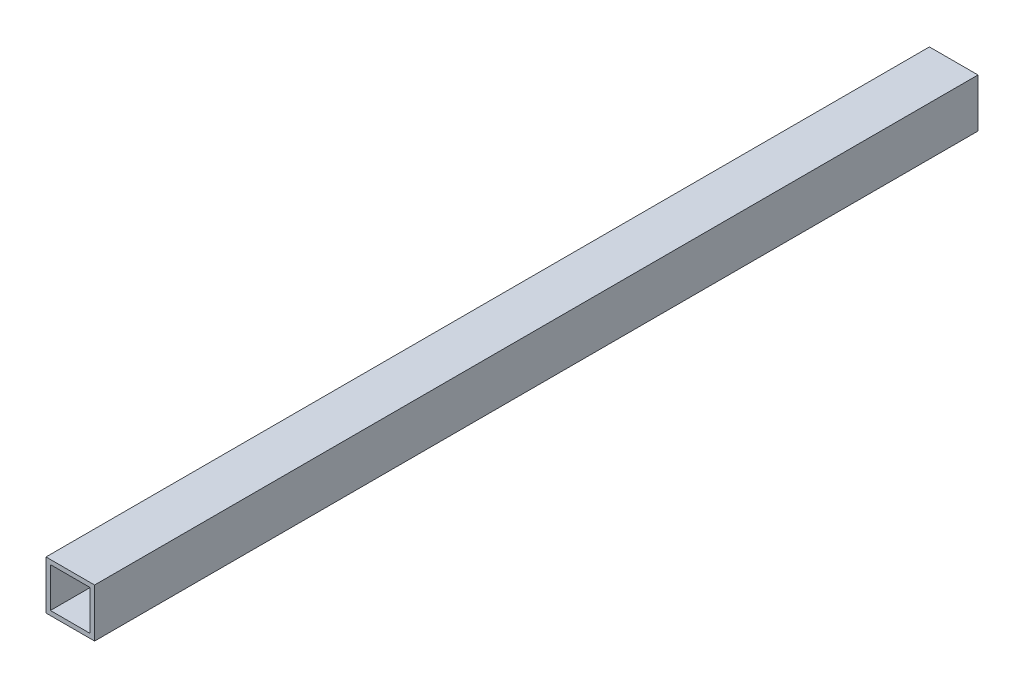
ISO-10303-21;
HEADER;
FILE_DESCRIPTION(('STEP AP214'),'2;1');
FILE_NAME('part.step','',(''),(''),'','','');
FILE_SCHEMA(('AUTOMOTIVE_DESIGN { 1 0 10303 214 1 1 1 1 }'));
ENDSEC;
DATA;
#1=APPLICATION_CONTEXT('core data for automotive mechanical design processes');
#2=APPLICATION_PROTOCOL_DEFINITION('international standard','automotive_design',2000,#1);
#3=PRODUCT_CONTEXT('',#1,'mechanical');
#4=PRODUCT('Part','Part','',(#3));
#5=PRODUCT_RELATED_PRODUCT_CATEGORY('part','',(#4));
#6=PRODUCT_DEFINITION_FORMATION('','',#4);
#7=PRODUCT_DEFINITION_CONTEXT('part definition',#1,'design');
#8=PRODUCT_DEFINITION('design','',#6,#7);
#9=PRODUCT_DEFINITION_SHAPE('','',#8);
#10=(LENGTH_UNIT() NAMED_UNIT(*) SI_UNIT(.MILLI.,.METRE.));
#11=(NAMED_UNIT(*) PLANE_ANGLE_UNIT() SI_UNIT($,.RADIAN.));
#12=(NAMED_UNIT(*) SI_UNIT($,.STERADIAN.) SOLID_ANGLE_UNIT());
#13=UNCERTAINTY_MEASURE_WITH_UNIT(LENGTH_MEASURE(1.E-05),#10,'distance_accuracy_value','');
#14=(GEOMETRIC_REPRESENTATION_CONTEXT(3) GLOBAL_UNCERTAINTY_ASSIGNED_CONTEXT((#13)) GLOBAL_UNIT_ASSIGNED_CONTEXT((#10,
#11,#12)) REPRESENTATION_CONTEXT('',''));
#15=CARTESIAN_POINT('',(0.,0.,0.));
#16=DIRECTION('',(0.,0.,1.));
#17=DIRECTION('',(1.,0.,0.));
#18=AXIS2_PLACEMENT_3D('',#15,#16,#17);
#19=CARTESIAN_POINT('',(0.,0.,400.));
#20=DIRECTION('',(0.,0.,1.));
#21=DIRECTION('',(1.,0.,0.));
#22=AXIS2_PLACEMENT_3D('',#19,#20,#21);
#23=PLANE('',#22);
#24=DIRECTION('',(0.,1.,0.));
#25=VECTOR('',#24,1.);
#26=CARTESIAN_POINT('',(3.29411764705882,39.0294117647059,400.));
#27=LINE('',#26,#25);
#28=CARTESIAN_POINT('',(3.29411764705882,-2.97058823529412,400.));
#29=VERTEX_POINT('',#28);
#30=CARTESIAN_POINT('',(3.29411764705882,41.0294117647059,400.));
#31=VERTEX_POINT('',#30);
#32=EDGE_CURVE('E177',#29,#31,#27,.T.);
#33=ORIENTED_EDGE('',*,*,#32,.T.);
#34=DIRECTION('',(-1.,0.,0.));
#35=VECTOR('',#34,1.);
#36=CARTESIAN_POINT('',(-38.7058823529412,41.0294117647059,400.));
#37=LINE('',#36,#35);
#38=CARTESIAN_POINT('',(-40.7058823529412,41.0294117647059,400.));
#39=VERTEX_POINT('',#38);
#40=EDGE_CURVE('E181',#31,#39,#37,.T.);
#41=ORIENTED_EDGE('',*,*,#40,.T.);
#42=DIRECTION('',(0.,-1.,0.));
#43=VECTOR('',#42,1.);
#44=CARTESIAN_POINT('',(-40.7058823529412,39.0294117647059,400.));
#45=LINE('',#44,#43);
#46=CARTESIAN_POINT('',(-40.7058823529412,-2.97058823529412,400.));
#47=VERTEX_POINT('',#46);
#48=EDGE_CURVE('E185',#39,#47,#45,.T.);
#49=ORIENTED_EDGE('',*,*,#48,.T.);
#50=DIRECTION('',(1.,0.,0.));
#51=VECTOR('',#50,1.);
#52=CARTESIAN_POINT('',(-38.7058823529412,-2.97058823529412,400.));
#53=LINE('',#52,#51);
#54=EDGE_CURVE('E188',#47,#29,#53,.T.);
#55=ORIENTED_EDGE('',*,*,#54,.T.);
#56=EDGE_LOOP('',(#33,#41,#49,#55));
#57=FACE_BOUND('',#56,.T.);
#58=DIRECTION('',(-1.,0.,0.));
#59=VECTOR('',#58,1.);
#60=CARTESIAN_POINT('',(-38.7058823529412,37.0294117647059,400.));
#61=LINE('',#60,#59);
#62=CARTESIAN_POINT('',(-0.705882352941183,37.0294117647059,400.));
#63=VERTEX_POINT('',#62);
#64=CARTESIAN_POINT('',(-36.7058823529412,37.0294117647059,400.));
#65=VERTEX_POINT('',#64);
#66=EDGE_CURVE('E138',#63,#65,#61,.T.);
#67=ORIENTED_EDGE('',*,*,#66,.F.);
#68=DIRECTION('',(0.,1.,0.));
#69=VECTOR('',#68,1.);
#70=CARTESIAN_POINT('',(-0.705882352941183,39.0294117647059,400.));
#71=LINE('',#70,#69);
#72=CARTESIAN_POINT('',(-0.705882352941178,1.02941176470588,400.));
#73=VERTEX_POINT('',#72);
#74=EDGE_CURVE('E129',#73,#63,#71,.T.);
#75=ORIENTED_EDGE('',*,*,#74,.F.);
#76=DIRECTION('',(1.,0.,0.));
#77=VECTOR('',#76,1.);
#78=CARTESIAN_POINT('',(-38.7058823529412,1.02941176470588,400.));
#79=LINE('',#78,#77);
#80=CARTESIAN_POINT('',(-36.7058823529412,1.02941176470588,400.));
#81=VERTEX_POINT('',#80);
#82=EDGE_CURVE('E155',#81,#73,#79,.T.);
#83=ORIENTED_EDGE('',*,*,#82,.F.);
#84=DIRECTION('',(0.,-1.,0.));
#85=VECTOR('',#84,1.);
#86=CARTESIAN_POINT('',(-36.7058823529412,39.0294117647059,400.));
#87=LINE('',#86,#85);
#88=EDGE_CURVE('E151',#65,#81,#87,.T.);
#89=ORIENTED_EDGE('',*,*,#88,.F.);
#90=EDGE_LOOP('',(#67,#75,#83,#89));
#91=FACE_BOUND('',#90,.T.);
#92=ADVANCED_FACE('F63',(#57,#91),#23,.T.);
#93=CARTESIAN_POINT('',(0.,0.,-400.));
#94=DIRECTION('',(0.,0.,1.));
#95=DIRECTION('',(1.,0.,0.));
#96=AXIS2_PLACEMENT_3D('',#93,#94,#95);
#97=PLANE('',#96);
#98=DIRECTION('',(0.,1.,0.));
#99=VECTOR('',#98,1.);
#100=CARTESIAN_POINT('',(3.29411764705882,39.0294117647059,-400.));
#101=LINE('',#100,#99);
#102=CARTESIAN_POINT('',(3.29411764705882,-2.97058823529412,-400.));
#103=VERTEX_POINT('',#102);
#104=CARTESIAN_POINT('',(3.29411764705882,41.0294117647059,-400.));
#105=VERTEX_POINT('',#104);
#106=EDGE_CURVE('E147',#103,#105,#101,.T.);
#107=ORIENTED_EDGE('',*,*,#106,.F.);
#108=DIRECTION('',(1.,0.,0.));
#109=VECTOR('',#108,1.);
#110=CARTESIAN_POINT('',(-38.7058823529412,-2.97058823529412,-400.));
#111=LINE('',#110,#109);
#112=CARTESIAN_POINT('',(-40.7058823529412,-2.97058823529412,-400.));
#113=VERTEX_POINT('',#112);
#114=EDGE_CURVE('E182',#113,#103,#111,.T.);
#115=ORIENTED_EDGE('',*,*,#114,.F.);
#116=DIRECTION('',(0.,-1.,0.));
#117=VECTOR('',#116,1.);
#118=CARTESIAN_POINT('',(-40.7058823529412,39.0294117647059,-400.));
#119=LINE('',#118,#117);
#120=CARTESIAN_POINT('',(-40.7058823529412,41.0294117647059,-400.));
#121=VERTEX_POINT('',#120);
#122=EDGE_CURVE('E198',#121,#113,#119,.T.);
#123=ORIENTED_EDGE('',*,*,#122,.F.);
#124=DIRECTION('',(-1.,0.,0.));
#125=VECTOR('',#124,1.);
#126=CARTESIAN_POINT('',(-38.7058823529412,41.0294117647059,-400.));
#127=LINE('',#126,#125);
#128=EDGE_CURVE('E195',#105,#121,#127,.T.);
#129=ORIENTED_EDGE('',*,*,#128,.F.);
#130=EDGE_LOOP('',(#107,#115,#123,#129));
#131=FACE_BOUND('',#130,.T.);
#132=DIRECTION('',(0.,1.,0.));
#133=VECTOR('',#132,1.);
#134=CARTESIAN_POINT('',(-0.705882352941183,39.0294117647059,-400.));
#135=LINE('',#134,#133);
#136=CARTESIAN_POINT('',(-0.705882352941178,1.02941176470588,-400.));
#137=VERTEX_POINT('',#136);
#138=CARTESIAN_POINT('',(-0.705882352941183,37.0294117647059,-400.));
#139=VERTEX_POINT('',#138);
#140=EDGE_CURVE('E87',#137,#139,#135,.T.);
#141=ORIENTED_EDGE('',*,*,#140,.T.);
#142=DIRECTION('',(-1.,0.,0.));
#143=VECTOR('',#142,1.);
#144=CARTESIAN_POINT('',(-38.7058823529412,37.0294117647059,-400.));
#145=LINE('',#144,#143);
#146=CARTESIAN_POINT('',(-36.7058823529412,37.0294117647059,-400.));
#147=VERTEX_POINT('',#146);
#148=EDGE_CURVE('E145',#139,#147,#145,.T.);
#149=ORIENTED_EDGE('',*,*,#148,.T.);
#150=DIRECTION('',(0.,-1.,0.));
#151=VECTOR('',#150,1.);
#152=CARTESIAN_POINT('',(-36.7058823529412,39.0294117647059,-400.));
#153=LINE('',#152,#151);
#154=CARTESIAN_POINT('',(-36.7058823529412,1.02941176470588,-400.));
#155=VERTEX_POINT('',#154);
#156=EDGE_CURVE('E164',#147,#155,#153,.T.);
#157=ORIENTED_EDGE('',*,*,#156,.T.);
#158=DIRECTION('',(1.,0.,0.));
#159=VECTOR('',#158,1.);
#160=CARTESIAN_POINT('',(-38.7058823529412,1.02941176470588,-400.));
#161=LINE('',#160,#159);
#162=EDGE_CURVE('E139',#155,#137,#161,.T.);
#163=ORIENTED_EDGE('',*,*,#162,.T.);
#164=EDGE_LOOP('',(#141,#149,#157,#163));
#165=FACE_BOUND('',#164,.T.);
#166=ADVANCED_FACE('F221',(#131,#165),#97,.F.);
#167=CARTESIAN_POINT('',(3.29411764705882,39.0294117647059,400.));
#168=DIRECTION('',(-1.,0.,0.));
#169=DIRECTION('',(0.,-1.,0.));
#170=AXIS2_PLACEMENT_3D('',#167,#168,#169);
#171=PLANE('',#170);
#172=ORIENTED_EDGE('',*,*,#106,.T.);
#173=DIRECTION('',(0.,0.,-1.));
#174=VECTOR('',#173,1.);
#175=CARTESIAN_POINT('',(3.29411764705882,41.0294117647059,400.));
#176=LINE('',#175,#174);
#177=EDGE_CURVE('E12',#31,#105,#176,.T.);
#178=ORIENTED_EDGE('',*,*,#177,.F.);
#179=ORIENTED_EDGE('',*,*,#32,.F.);
#180=DIRECTION('',(0.,0.,-1.));
#181=VECTOR('',#180,1.);
#182=CARTESIAN_POINT('',(3.29411764705882,-2.97058823529412,400.));
#183=LINE('',#182,#181);
#184=EDGE_CURVE('E191',#29,#103,#183,.T.);
#185=ORIENTED_EDGE('',*,*,#184,.T.);
#186=EDGE_LOOP('',(#172,#178,#179,#185));
#187=FACE_BOUND('',#186,.T.);
#188=ADVANCED_FACE('F65',(#187),#171,.F.);
#189=CARTESIAN_POINT('',(-38.7058823529412,41.0294117647059,400.));
#190=DIRECTION('',(0.,-1.,0.));
#191=DIRECTION('',(1.,0.,0.));
#192=AXIS2_PLACEMENT_3D('',#189,#190,#191);
#193=PLANE('',#192);
#194=ORIENTED_EDGE('',*,*,#128,.T.);
#195=DIRECTION('',(0.,0.,-1.));
#196=VECTOR('',#195,1.);
#197=CARTESIAN_POINT('',(-40.7058823529412,41.0294117647059,400.));
#198=LINE('',#197,#196);
#199=EDGE_CURVE('E72',#39,#121,#198,.T.);
#200=ORIENTED_EDGE('',*,*,#199,.F.);
#201=ORIENTED_EDGE('',*,*,#40,.F.);
#202=ORIENTED_EDGE('',*,*,#177,.T.);
#203=EDGE_LOOP('',(#194,#200,#201,#202));
#204=FACE_BOUND('',#203,.T.);
#205=ADVANCED_FACE('F231',(#204),#193,.F.);
#206=CARTESIAN_POINT('',(-40.7058823529412,39.0294117647059,400.));
#207=DIRECTION('',(1.,0.,0.));
#208=DIRECTION('',(0.,0.,-1.));
#209=AXIS2_PLACEMENT_3D('',#206,#207,#208);
#210=PLANE('',#209);
#211=ORIENTED_EDGE('',*,*,#122,.T.);
#212=DIRECTION('',(0.,0.,-1.));
#213=VECTOR('',#212,1.);
#214=CARTESIAN_POINT('',(-40.7058823529412,-2.97058823529412,400.));
#215=LINE('',#214,#213);
#216=EDGE_CURVE('E206',#47,#113,#215,.T.);
#217=ORIENTED_EDGE('',*,*,#216,.F.);
#218=ORIENTED_EDGE('',*,*,#48,.F.);
#219=ORIENTED_EDGE('',*,*,#199,.T.);
#220=EDGE_LOOP('',(#211,#217,#218,#219));
#221=FACE_BOUND('',#220,.T.);
#222=ADVANCED_FACE('F215',(#221),#210,.F.);
#223=CARTESIAN_POINT('',(-38.7058823529412,-2.97058823529412,400.));
#224=DIRECTION('',(0.,1.,0.));
#225=DIRECTION('',(0.,0.,1.));
#226=AXIS2_PLACEMENT_3D('',#223,#224,#225);
#227=PLANE('',#226);
#228=ORIENTED_EDGE('',*,*,#114,.T.);
#229=ORIENTED_EDGE('',*,*,#184,.F.);
#230=ORIENTED_EDGE('',*,*,#54,.F.);
#231=ORIENTED_EDGE('',*,*,#216,.T.);
#232=EDGE_LOOP('',(#228,#229,#230,#231));
#233=FACE_BOUND('',#232,.T.);
#234=ADVANCED_FACE('F225',(#233),#227,.F.);
#235=CARTESIAN_POINT('',(-0.705882352941183,39.0294117647059,400.));
#236=DIRECTION('',(-1.,0.,0.));
#237=DIRECTION('',(0.,-1.,0.));
#238=AXIS2_PLACEMENT_3D('',#235,#236,#237);
#239=PLANE('',#238);
#240=ORIENTED_EDGE('',*,*,#140,.F.);
#241=DIRECTION('',(0.,0.,-1.));
#242=VECTOR('',#241,1.);
#243=CARTESIAN_POINT('',(-0.705882352941178,1.02941176470588,400.));
#244=LINE('',#243,#242);
#245=EDGE_CURVE('E133',#73,#137,#244,.T.);
#246=ORIENTED_EDGE('',*,*,#245,.F.);
#247=ORIENTED_EDGE('',*,*,#74,.T.);
#248=DIRECTION('',(0.,0.,-1.));
#249=VECTOR('',#248,1.);
#250=CARTESIAN_POINT('',(-0.705882352941183,37.0294117647059,400.));
#251=LINE('',#250,#249);
#252=EDGE_CURVE('E132',#63,#139,#251,.T.);
#253=ORIENTED_EDGE('',*,*,#252,.T.);
#254=EDGE_LOOP('',(#240,#246,#247,#253));
#255=FACE_BOUND('',#254,.T.);
#256=ADVANCED_FACE('F131',(#255),#239,.T.);
#257=CARTESIAN_POINT('',(-38.7058823529412,37.0294117647059,400.));
#258=DIRECTION('',(0.,-1.,0.));
#259=DIRECTION('',(1.,0.,0.));
#260=AXIS2_PLACEMENT_3D('',#257,#258,#259);
#261=PLANE('',#260);
#262=ORIENTED_EDGE('',*,*,#148,.F.);
#263=ORIENTED_EDGE('',*,*,#252,.F.);
#264=ORIENTED_EDGE('',*,*,#66,.T.);
#265=DIRECTION('',(0.,0.,-1.));
#266=VECTOR('',#265,1.);
#267=CARTESIAN_POINT('',(-36.7058823529412,37.0294117647059,400.));
#268=LINE('',#267,#266);
#269=EDGE_CURVE('E148',#65,#147,#268,.T.);
#270=ORIENTED_EDGE('',*,*,#269,.T.);
#271=EDGE_LOOP('',(#262,#263,#264,#270));
#272=FACE_BOUND('',#271,.T.);
#273=ADVANCED_FACE('F142',(#272),#261,.T.);
#274=CARTESIAN_POINT('',(-36.7058823529412,39.0294117647059,400.));
#275=DIRECTION('',(1.,0.,0.));
#276=DIRECTION('',(0.,0.,-1.));
#277=AXIS2_PLACEMENT_3D('',#274,#275,#276);
#278=PLANE('',#277);
#279=ORIENTED_EDGE('',*,*,#156,.F.);
#280=ORIENTED_EDGE('',*,*,#269,.F.);
#281=ORIENTED_EDGE('',*,*,#88,.T.);
#282=DIRECTION('',(0.,0.,-1.));
#283=VECTOR('',#282,1.);
#284=CARTESIAN_POINT('',(-36.7058823529412,1.02941176470588,400.));
#285=LINE('',#284,#283);
#286=EDGE_CURVE('E79',#81,#155,#285,.T.);
#287=ORIENTED_EDGE('',*,*,#286,.T.);
#288=EDGE_LOOP('',(#279,#280,#281,#287));
#289=FACE_BOUND('',#288,.T.);
#290=ADVANCED_FACE('F254',(#289),#278,.T.);
#291=CARTESIAN_POINT('',(-38.7058823529412,1.02941176470588,400.));
#292=DIRECTION('',(0.,1.,0.));
#293=DIRECTION('',(0.,0.,1.));
#294=AXIS2_PLACEMENT_3D('',#291,#292,#293);
#295=PLANE('',#294);
#296=ORIENTED_EDGE('',*,*,#162,.F.);
#297=ORIENTED_EDGE('',*,*,#286,.F.);
#298=ORIENTED_EDGE('',*,*,#82,.T.);
#299=ORIENTED_EDGE('',*,*,#245,.T.);
#300=EDGE_LOOP('',(#296,#297,#298,#299));
#301=FACE_BOUND('',#300,.T.);
#302=ADVANCED_FACE('F258',(#301),#295,.T.);
#303=CLOSED_SHELL('',(#92,#166,#188,#205,#222,#234,#256,#273,#290,#302));
#304=MANIFOLD_SOLID_BREP('B2',#303);
#305=ADVANCED_BREP_SHAPE_REPRESENTATION('',(#18,#304),#14);
#306=SHAPE_DEFINITION_REPRESENTATION(#9,#305);
ENDSEC;
END-ISO-10303-21;
